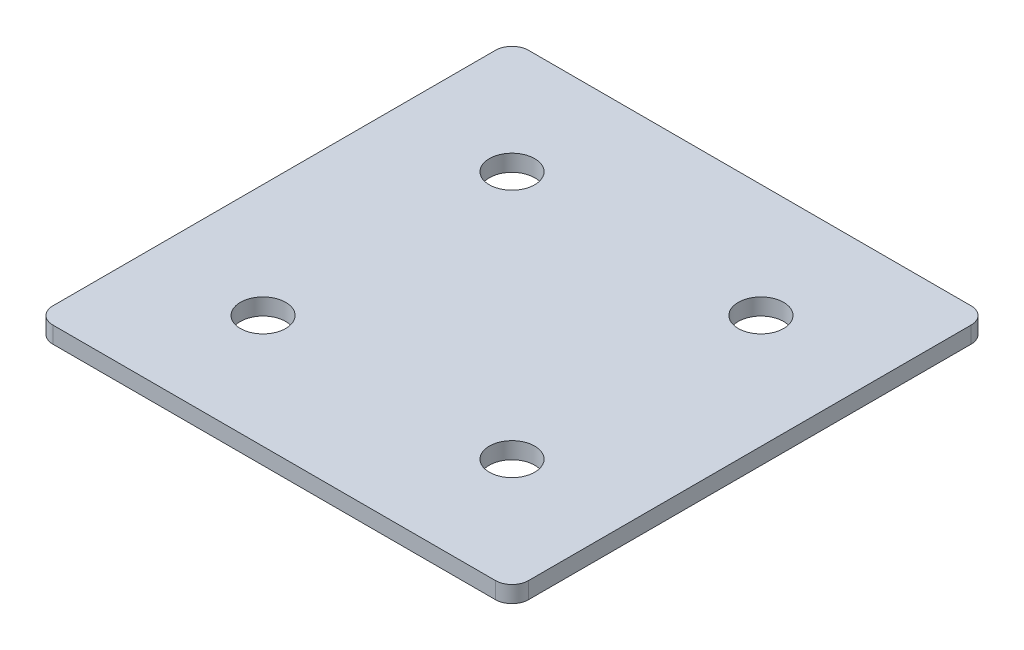
ISO-10303-21;
HEADER;
FILE_DESCRIPTION(('STEP AP214'),'2;1');
FILE_NAME('part.step','',(''),(''),'','','');
FILE_SCHEMA(('AUTOMOTIVE_DESIGN { 1 0 10303 214 1 1 1 1 }'));
ENDSEC;
DATA;
#1=APPLICATION_CONTEXT('core data for automotive mechanical design processes');
#2=APPLICATION_PROTOCOL_DEFINITION('international standard','automotive_design',2000,#1);
#3=PRODUCT_CONTEXT('',#1,'mechanical');
#4=PRODUCT('Part','Part','',(#3));
#5=PRODUCT_RELATED_PRODUCT_CATEGORY('part','',(#4));
#6=PRODUCT_DEFINITION_FORMATION('','',#4);
#7=PRODUCT_DEFINITION_CONTEXT('part definition',#1,'design');
#8=PRODUCT_DEFINITION('design','',#6,#7);
#9=PRODUCT_DEFINITION_SHAPE('','',#8);
#10=(LENGTH_UNIT() NAMED_UNIT(*) SI_UNIT(.MILLI.,.METRE.));
#11=(NAMED_UNIT(*) PLANE_ANGLE_UNIT() SI_UNIT($,.RADIAN.));
#12=(NAMED_UNIT(*) SI_UNIT($,.STERADIAN.) SOLID_ANGLE_UNIT());
#13=UNCERTAINTY_MEASURE_WITH_UNIT(LENGTH_MEASURE(1.E-05),#10,'distance_accuracy_value','');
#14=(GEOMETRIC_REPRESENTATION_CONTEXT(3) GLOBAL_UNCERTAINTY_ASSIGNED_CONTEXT((#13)) GLOBAL_UNIT_ASSIGNED_CONTEXT((#10,
#11,#12)) REPRESENTATION_CONTEXT('',''));
#15=CARTESIAN_POINT('',(0.,0.,0.));
#16=DIRECTION('',(0.,0.,1.));
#17=DIRECTION('',(1.,0.,0.));
#18=AXIS2_PLACEMENT_3D('',#15,#16,#17);
#19=CARTESIAN_POINT('',(-1.48251179552972,1.64126526075142,-24.1582429630034));
#20=DIRECTION('',(0.,-1.,0.));
#21=DIRECTION('',(0.,0.,-1.));
#22=AXIS2_PLACEMENT_3D('',#19,#20,#21);
#23=PLANE('',#22);
#24=CARTESIAN_POINT('',(21.0174882044703,1.64126526075142,20.8417570369966));
#25=DIRECTION('',(0.,1.,0.));
#26=DIRECTION('',(0.,0.,1.));
#27=AXIS2_PLACEMENT_3D('',#24,#25,#26);
#28=CIRCLE('',#27,4.1);
#29=CARTESIAN_POINT('',(21.0174882044703,1.64126526075142,24.9417570369966));
#30=VERTEX_POINT('',#29);
#31=EDGE_CURVE('E165',#30,#30,#28,.T.);
#32=ORIENTED_EDGE('',*,*,#31,.T.);
#33=EDGE_LOOP('',(#32));
#34=FACE_BOUND('',#33,.T.);
#35=CARTESIAN_POINT('',(-23.9825117955298,1.64126526075142,20.8417570369966));
#36=DIRECTION('',(0.,1.,0.));
#37=DIRECTION('',(0.,0.,1.));
#38=AXIS2_PLACEMENT_3D('',#35,#36,#37);
#39=CIRCLE('',#38,4.1);
#40=CARTESIAN_POINT('',(-23.9825117955298,1.64126526075142,24.9417570369966));
#41=VERTEX_POINT('',#40);
#42=EDGE_CURVE('E159',#41,#41,#39,.T.);
#43=ORIENTED_EDGE('',*,*,#42,.T.);
#44=EDGE_LOOP('',(#43));
#45=FACE_BOUND('',#44,.T.);
#46=CARTESIAN_POINT('',(21.0174882044703,1.64126526075142,-24.1582429630034));
#47=DIRECTION('',(0.,1.,0.));
#48=DIRECTION('',(0.,0.,1.));
#49=AXIS2_PLACEMENT_3D('',#46,#47,#48);
#50=CIRCLE('',#49,4.1);
#51=CARTESIAN_POINT('',(21.0174882044703,1.64126526075142,-20.0582429630034));
#52=VERTEX_POINT('',#51);
#53=EDGE_CURVE('E154',#52,#52,#50,.T.);
#54=ORIENTED_EDGE('',*,*,#53,.T.);
#55=EDGE_LOOP('',(#54));
#56=FACE_BOUND('',#55,.T.);
#57=CARTESIAN_POINT('',(-23.9825117955298,1.64126526075142,-24.1582429630034));
#58=DIRECTION('',(0.,1.,0.));
#59=DIRECTION('',(0.,0.,1.));
#60=AXIS2_PLACEMENT_3D('',#57,#58,#59);
#61=CIRCLE('',#60,4.1);
#62=CARTESIAN_POINT('',(-23.9825117955298,1.64126526075142,-20.0582429630034));
#63=VERTEX_POINT('',#62);
#64=EDGE_CURVE('E147',#63,#63,#61,.T.);
#65=ORIENTED_EDGE('',*,*,#64,.T.);
#66=EDGE_LOOP('',(#65));
#67=FACE_BOUND('',#66,.T.);
#68=DIRECTION('',(0.,0.,-1.));
#69=VECTOR('',#68,1.);
#70=CARTESIAN_POINT('',(41.5174882044704,1.64126526075142,41.3417570369966));
#71=LINE('',#70,#69);
#72=CARTESIAN_POINT('',(41.5174882044704,1.64126526075142,38.3417570369966));
#73=VERTEX_POINT('',#72);
#74=CARTESIAN_POINT('',(41.5174882044704,1.64126526075142,-41.6582429630034));
#75=VERTEX_POINT('',#74);
#76=EDGE_CURVE('E106',#73,#75,#71,.T.);
#77=ORIENTED_EDGE('',*,*,#76,.F.);
#78=CARTESIAN_POINT('',(38.5174882044704,1.64126526075142,38.3417570369966));
#79=DIRECTION('',(0.,-1.,0.));
#80=DIRECTION('',(0.,0.,-1.));
#81=AXIS2_PLACEMENT_3D('',#78,#79,#80);
#82=CIRCLE('',#81,3.);
#83=CARTESIAN_POINT('',(38.5174882044704,1.64126526075142,41.3417570369966));
#84=VERTEX_POINT('',#83);
#85=EDGE_CURVE('E128',#73,#84,#82,.T.);
#86=ORIENTED_EDGE('',*,*,#85,.T.);
#87=DIRECTION('',(1.,0.,0.));
#88=VECTOR('',#87,1.);
#89=CARTESIAN_POINT('',(-44.4825117955298,1.64126526075142,41.3417570369966));
#90=LINE('',#89,#88);
#91=CARTESIAN_POINT('',(-41.4825117955298,1.64126526075142,41.3417570369966));
#92=VERTEX_POINT('',#91);
#93=EDGE_CURVE('E110',#92,#84,#90,.T.);
#94=ORIENTED_EDGE('',*,*,#93,.F.);
#95=CARTESIAN_POINT('',(-41.4825117955298,1.64126526075142,38.3417570369966));
#96=DIRECTION('',(0.,-1.,0.));
#97=DIRECTION('',(0.,0.,-1.));
#98=AXIS2_PLACEMENT_3D('',#95,#96,#97);
#99=CIRCLE('',#98,3.);
#100=CARTESIAN_POINT('',(-44.4825117955298,1.64126526075142,38.3417570369966));
#101=VERTEX_POINT('',#100);
#102=EDGE_CURVE('E105',#92,#101,#99,.T.);
#103=ORIENTED_EDGE('',*,*,#102,.T.);
#104=DIRECTION('',(0.,0.,1.));
#105=VECTOR('',#104,1.);
#106=CARTESIAN_POINT('',(-44.4825117955298,1.64126526075142,-44.6582429630034));
#107=LINE('',#106,#105);
#108=CARTESIAN_POINT('',(-44.4825117955298,1.64126526075142,-41.6582429630034));
#109=VERTEX_POINT('',#108);
#110=EDGE_CURVE('E137',#109,#101,#107,.T.);
#111=ORIENTED_EDGE('',*,*,#110,.F.);
#112=CARTESIAN_POINT('',(-41.4825117955298,1.64126526075142,-41.6582429630034));
#113=DIRECTION('',(0.,-1.,0.));
#114=DIRECTION('',(0.,0.,-1.));
#115=AXIS2_PLACEMENT_3D('',#112,#113,#114);
#116=CIRCLE('',#115,3.);
#117=CARTESIAN_POINT('',(-41.4825117955298,1.64126526075142,-44.6582429630034));
#118=VERTEX_POINT('',#117);
#119=EDGE_CURVE('E31',#109,#118,#116,.T.);
#120=ORIENTED_EDGE('',*,*,#119,.T.);
#121=DIRECTION('',(-1.,0.,0.));
#122=VECTOR('',#121,1.);
#123=CARTESIAN_POINT('',(41.5174882044704,1.64126526075142,-44.6582429630034));
#124=LINE('',#123,#122);
#125=CARTESIAN_POINT('',(38.5174882044704,1.64126526075142,-44.6582429630034));
#126=VERTEX_POINT('',#125);
#127=EDGE_CURVE('E138',#126,#118,#124,.T.);
#128=ORIENTED_EDGE('',*,*,#127,.F.);
#129=CARTESIAN_POINT('',(38.5174882044704,1.64126526075142,-41.6582429630034));
#130=DIRECTION('',(0.,-1.,0.));
#131=DIRECTION('',(0.,0.,-1.));
#132=AXIS2_PLACEMENT_3D('',#129,#130,#131);
#133=CIRCLE('',#132,3.);
#134=EDGE_CURVE('E126',#126,#75,#133,.T.);
#135=ORIENTED_EDGE('',*,*,#134,.T.);
#136=EDGE_LOOP('',(#77,#86,#94,#103,#111,#120,#128,#135));
#137=FACE_BOUND('',#136,.T.);
#138=ADVANCED_FACE('F16',(#34,#45,#56,#67,#137),#23,.T.);
#139=CARTESIAN_POINT('',(41.5174882044704,1.64126526075142,-44.6582429630034));
#140=DIRECTION('',(0.,0.,-1.));
#141=DIRECTION('',(-1.,0.,0.));
#142=AXIS2_PLACEMENT_3D('',#139,#140,#141);
#143=PLANE('',#142);
#144=DIRECTION('',(-1.,0.,0.));
#145=VECTOR('',#144,1.);
#146=CARTESIAN_POINT('',(41.5174882044704,4.64126526075142,-44.6582429630034));
#147=LINE('',#146,#145);
#148=CARTESIAN_POINT('',(38.5174882044704,4.64126526075142,-44.6582429630034));
#149=VERTEX_POINT('',#148);
#150=CARTESIAN_POINT('',(-41.4825117955298,4.64126526075142,-44.6582429630034));
#151=VERTEX_POINT('',#150);
#152=EDGE_CURVE('E144',#149,#151,#147,.T.);
#153=ORIENTED_EDGE('',*,*,#152,.F.);
#154=DIRECTION('',(0.,1.,0.));
#155=VECTOR('',#154,1.);
#156=CARTESIAN_POINT('',(38.5174882044704,1.64126526075142,-44.6582429630034));
#157=LINE('',#156,#155);
#158=EDGE_CURVE('E38',#149,#126,#157,.F.);
#159=ORIENTED_EDGE('',*,*,#158,.T.);
#160=ORIENTED_EDGE('',*,*,#127,.T.);
#161=DIRECTION('',(0.,1.,0.));
#162=VECTOR('',#161,1.);
#163=CARTESIAN_POINT('',(-41.4825117955298,1.64126526075142,-44.6582429630034));
#164=LINE('',#163,#162);
#165=EDGE_CURVE('E130',#118,#151,#164,.T.);
#166=ORIENTED_EDGE('',*,*,#165,.T.);
#167=EDGE_LOOP('',(#153,#159,#160,#166));
#168=FACE_BOUND('',#167,.T.);
#169=ADVANCED_FACE('F206',(#168),#143,.T.);
#170=CARTESIAN_POINT('',(41.5174882044704,1.64126526075142,41.3417570369966));
#171=DIRECTION('',(1.,0.,0.));
#172=DIRECTION('',(0.,0.,-1.));
#173=AXIS2_PLACEMENT_3D('',#170,#171,#172);
#174=PLANE('',#173);
#175=DIRECTION('',(0.,0.,-1.));
#176=VECTOR('',#175,1.);
#177=CARTESIAN_POINT('',(41.5174882044704,4.64126526075142,41.3417570369966));
#178=LINE('',#177,#176);
#179=CARTESIAN_POINT('',(41.5174882044704,4.64126526075142,38.3417570369966));
#180=VERTEX_POINT('',#179);
#181=CARTESIAN_POINT('',(41.5174882044704,4.64126526075142,-41.6582429630034));
#182=VERTEX_POINT('',#181);
#183=EDGE_CURVE('E102',#180,#182,#178,.T.);
#184=ORIENTED_EDGE('',*,*,#183,.F.);
#185=DIRECTION('',(0.,1.,0.));
#186=VECTOR('',#185,1.);
#187=CARTESIAN_POINT('',(41.5174882044704,1.64126526075142,38.3417570369966));
#188=LINE('',#187,#186);
#189=EDGE_CURVE('E122',#180,#73,#188,.F.);
#190=ORIENTED_EDGE('',*,*,#189,.T.);
#191=ORIENTED_EDGE('',*,*,#76,.T.);
#192=DIRECTION('',(0.,1.,0.));
#193=VECTOR('',#192,1.);
#194=CARTESIAN_POINT('',(41.5174882044704,1.64126526075142,-41.6582429630034));
#195=LINE('',#194,#193);
#196=EDGE_CURVE('E119',#75,#182,#195,.T.);
#197=ORIENTED_EDGE('',*,*,#196,.T.);
#198=EDGE_LOOP('',(#184,#190,#191,#197));
#199=FACE_BOUND('',#198,.T.);
#200=ADVANCED_FACE('F211',(#199),#174,.T.);
#201=CARTESIAN_POINT('',(-44.4825117955298,1.64126526075142,41.3417570369966));
#202=DIRECTION('',(0.,0.,1.));
#203=DIRECTION('',(1.,0.,0.));
#204=AXIS2_PLACEMENT_3D('',#201,#202,#203);
#205=PLANE('',#204);
#206=ORIENTED_EDGE('',*,*,#93,.T.);
#207=DIRECTION('',(0.,1.,0.));
#208=VECTOR('',#207,1.);
#209=CARTESIAN_POINT('',(38.5174882044704,1.64126526075142,41.3417570369966));
#210=LINE('',#209,#208);
#211=CARTESIAN_POINT('',(38.5174882044704,4.64126526075142,41.3417570369966));
#212=VERTEX_POINT('',#211);
#213=EDGE_CURVE('E93',#84,#212,#210,.T.);
#214=ORIENTED_EDGE('',*,*,#213,.T.);
#215=DIRECTION('',(1.,0.,0.));
#216=VECTOR('',#215,1.);
#217=CARTESIAN_POINT('',(-44.4825117955298,4.64126526075142,41.3417570369966));
#218=LINE('',#217,#216);
#219=CARTESIAN_POINT('',(-41.4825117955298,4.64126526075142,41.3417570369966));
#220=VERTEX_POINT('',#219);
#221=EDGE_CURVE('E85',#220,#212,#218,.T.);
#222=ORIENTED_EDGE('',*,*,#221,.F.);
#223=DIRECTION('',(0.,1.,0.));
#224=VECTOR('',#223,1.);
#225=CARTESIAN_POINT('',(-41.4825117955298,1.64126526075142,41.3417570369966));
#226=LINE('',#225,#224);
#227=EDGE_CURVE('E99',#220,#92,#226,.F.);
#228=ORIENTED_EDGE('',*,*,#227,.T.);
#229=EDGE_LOOP('',(#206,#214,#222,#228));
#230=FACE_BOUND('',#229,.T.);
#231=ADVANCED_FACE('F98',(#230),#205,.T.);
#232=CARTESIAN_POINT('',(-44.4825117955298,1.64126526075142,-44.6582429630034));
#233=DIRECTION('',(-1.,0.,0.));
#234=DIRECTION('',(0.,0.,1.));
#235=AXIS2_PLACEMENT_3D('',#232,#233,#234);
#236=PLANE('',#235);
#237=DIRECTION('',(0.,0.,1.));
#238=VECTOR('',#237,1.);
#239=CARTESIAN_POINT('',(-44.4825117955298,4.64126526075142,-44.6582429630034));
#240=LINE('',#239,#238);
#241=CARTESIAN_POINT('',(-44.4825117955298,4.64126526075142,-41.6582429630034));
#242=VERTEX_POINT('',#241);
#243=CARTESIAN_POINT('',(-44.4825117955298,4.64126526075142,38.3417570369966));
#244=VERTEX_POINT('',#243);
#245=EDGE_CURVE('E87',#242,#244,#240,.T.);
#246=ORIENTED_EDGE('',*,*,#245,.F.);
#247=DIRECTION('',(0.,1.,0.));
#248=VECTOR('',#247,1.);
#249=CARTESIAN_POINT('',(-44.4825117955298,1.64126526075142,-41.6582429630034));
#250=LINE('',#249,#248);
#251=EDGE_CURVE('E10',#242,#109,#250,.F.);
#252=ORIENTED_EDGE('',*,*,#251,.T.);
#253=ORIENTED_EDGE('',*,*,#110,.T.);
#254=DIRECTION('',(0.,1.,0.));
#255=VECTOR('',#254,1.);
#256=CARTESIAN_POINT('',(-44.4825117955298,1.64126526075142,38.3417570369966));
#257=LINE('',#256,#255);
#258=EDGE_CURVE('E24',#101,#244,#257,.T.);
#259=ORIENTED_EDGE('',*,*,#258,.T.);
#260=EDGE_LOOP('',(#246,#252,#253,#259));
#261=FACE_BOUND('',#260,.T.);
#262=ADVANCED_FACE('F135',(#261),#236,.T.);
#263=CARTESIAN_POINT('',(-1.48251179552972,4.64126526075142,-24.1582429630034));
#264=DIRECTION('',(0.,-1.,0.));
#265=DIRECTION('',(0.,0.,-1.));
#266=AXIS2_PLACEMENT_3D('',#263,#264,#265);
#267=PLANE('',#266);
#268=CARTESIAN_POINT('',(21.0174882044703,4.64126526075142,20.8417570369966));
#269=DIRECTION('',(0.,1.,0.));
#270=DIRECTION('',(0.,0.,1.));
#271=AXIS2_PLACEMENT_3D('',#268,#269,#270);
#272=CIRCLE('',#271,4.1);
#273=CARTESIAN_POINT('',(21.0174882044703,4.64126526075142,24.9417570369966));
#274=VERTEX_POINT('',#273);
#275=EDGE_CURVE('E168',#274,#274,#272,.T.);
#276=ORIENTED_EDGE('',*,*,#275,.F.);
#277=EDGE_LOOP('',(#276));
#278=FACE_BOUND('',#277,.T.);
#279=CARTESIAN_POINT('',(-23.9825117955298,4.64126526075142,20.8417570369966));
#280=DIRECTION('',(0.,1.,0.));
#281=DIRECTION('',(0.,0.,1.));
#282=AXIS2_PLACEMENT_3D('',#279,#280,#281);
#283=CIRCLE('',#282,4.1);
#284=CARTESIAN_POINT('',(-23.9825117955298,4.64126526075142,24.9417570369966));
#285=VERTEX_POINT('',#284);
#286=EDGE_CURVE('E162',#285,#285,#283,.T.);
#287=ORIENTED_EDGE('',*,*,#286,.F.);
#288=EDGE_LOOP('',(#287));
#289=FACE_BOUND('',#288,.T.);
#290=CARTESIAN_POINT('',(21.0174882044703,4.64126526075142,-24.1582429630034));
#291=DIRECTION('',(0.,1.,0.));
#292=DIRECTION('',(0.,0.,1.));
#293=AXIS2_PLACEMENT_3D('',#290,#291,#292);
#294=CIRCLE('',#293,4.1);
#295=CARTESIAN_POINT('',(21.0174882044703,4.64126526075142,-20.0582429630034));
#296=VERTEX_POINT('',#295);
#297=EDGE_CURVE('E156',#296,#296,#294,.T.);
#298=ORIENTED_EDGE('',*,*,#297,.F.);
#299=EDGE_LOOP('',(#298));
#300=FACE_BOUND('',#299,.T.);
#301=CARTESIAN_POINT('',(-23.9825117955298,4.64126526075142,-24.1582429630034));
#302=DIRECTION('',(0.,1.,0.));
#303=DIRECTION('',(0.,0.,1.));
#304=AXIS2_PLACEMENT_3D('',#301,#302,#303);
#305=CIRCLE('',#304,4.1);
#306=CARTESIAN_POINT('',(-23.9825117955298,4.64126526075142,-20.0582429630034));
#307=VERTEX_POINT('',#306);
#308=EDGE_CURVE('E149',#307,#307,#305,.T.);
#309=ORIENTED_EDGE('',*,*,#308,.F.);
#310=EDGE_LOOP('',(#309));
#311=FACE_BOUND('',#310,.T.);
#312=ORIENTED_EDGE('',*,*,#221,.T.);
#313=CARTESIAN_POINT('',(38.5174882044704,4.64126526075142,38.3417570369966));
#314=DIRECTION('',(0.,-1.,0.));
#315=DIRECTION('',(0.,0.,-1.));
#316=AXIS2_PLACEMENT_3D('',#313,#314,#315);
#317=CIRCLE('',#316,3.);
#318=EDGE_CURVE('E117',#212,#180,#317,.F.);
#319=ORIENTED_EDGE('',*,*,#318,.T.);
#320=ORIENTED_EDGE('',*,*,#183,.T.);
#321=CARTESIAN_POINT('',(38.5174882044704,4.64126526075142,-41.6582429630034));
#322=DIRECTION('',(0.,-1.,0.));
#323=DIRECTION('',(0.,0.,-1.));
#324=AXIS2_PLACEMENT_3D('',#321,#322,#323);
#325=CIRCLE('',#324,3.);
#326=EDGE_CURVE('E115',#182,#149,#325,.F.);
#327=ORIENTED_EDGE('',*,*,#326,.T.);
#328=ORIENTED_EDGE('',*,*,#152,.T.);
#329=CARTESIAN_POINT('',(-41.4825117955298,4.64126526075142,-41.6582429630034));
#330=DIRECTION('',(0.,-1.,0.));
#331=DIRECTION('',(0.,0.,-1.));
#332=AXIS2_PLACEMENT_3D('',#329,#330,#331);
#333=CIRCLE('',#332,3.);
#334=EDGE_CURVE('E92',#151,#242,#333,.F.);
#335=ORIENTED_EDGE('',*,*,#334,.T.);
#336=ORIENTED_EDGE('',*,*,#245,.T.);
#337=CARTESIAN_POINT('',(-41.4825117955298,4.64126526075142,38.3417570369966));
#338=DIRECTION('',(0.,-1.,0.));
#339=DIRECTION('',(0.,0.,-1.));
#340=AXIS2_PLACEMENT_3D('',#337,#338,#339);
#341=CIRCLE('',#340,3.);
#342=EDGE_CURVE('E82',#244,#220,#341,.F.);
#343=ORIENTED_EDGE('',*,*,#342,.T.);
#344=EDGE_LOOP('',(#312,#319,#320,#327,#328,#335,#336,#343));
#345=FACE_BOUND('',#344,.T.);
#346=ADVANCED_FACE('F84',(#278,#289,#300,#311,#345),#267,.F.);
#347=CARTESIAN_POINT('',(-23.9825117955298,1.64126526075142,-24.1582429630034));
#348=DIRECTION('',(0.,1.,0.));
#349=DIRECTION('',(0.,0.,1.));
#350=AXIS2_PLACEMENT_3D('',#347,#348,#349);
#351=CYLINDRICAL_SURFACE('',#350,4.1);
#352=ORIENTED_EDGE('',*,*,#64,.F.);
#353=EDGE_LOOP('',(#352));
#354=FACE_BOUND('',#353,.T.);
#355=ORIENTED_EDGE('',*,*,#308,.T.);
#356=EDGE_LOOP('',(#355));
#357=FACE_BOUND('',#356,.T.);
#358=ADVANCED_FACE('F186',(#354,#357),#351,.F.);
#359=CARTESIAN_POINT('',(21.0174882044703,1.64126526075142,-24.1582429630034));
#360=DIRECTION('',(0.,1.,0.));
#361=DIRECTION('',(0.,0.,1.));
#362=AXIS2_PLACEMENT_3D('',#359,#360,#361);
#363=CYLINDRICAL_SURFACE('',#362,4.1);
#364=ORIENTED_EDGE('',*,*,#53,.F.);
#365=EDGE_LOOP('',(#364));
#366=FACE_BOUND('',#365,.T.);
#367=ORIENTED_EDGE('',*,*,#297,.T.);
#368=EDGE_LOOP('',(#367));
#369=FACE_BOUND('',#368,.T.);
#370=ADVANCED_FACE('F195',(#366,#369),#363,.F.);
#371=CARTESIAN_POINT('',(-23.9825117955298,1.64126526075142,20.8417570369966));
#372=DIRECTION('',(0.,1.,0.));
#373=DIRECTION('',(0.,0.,1.));
#374=AXIS2_PLACEMENT_3D('',#371,#372,#373);
#375=CYLINDRICAL_SURFACE('',#374,4.1);
#376=ORIENTED_EDGE('',*,*,#42,.F.);
#377=EDGE_LOOP('',(#376));
#378=FACE_BOUND('',#377,.T.);
#379=ORIENTED_EDGE('',*,*,#286,.T.);
#380=EDGE_LOOP('',(#379));
#381=FACE_BOUND('',#380,.T.);
#382=ADVANCED_FACE('F180',(#378,#381),#375,.F.);
#383=CARTESIAN_POINT('',(21.0174882044703,1.64126526075142,20.8417570369966));
#384=DIRECTION('',(0.,1.,0.));
#385=DIRECTION('',(0.,0.,1.));
#386=AXIS2_PLACEMENT_3D('',#383,#384,#385);
#387=CYLINDRICAL_SURFACE('',#386,4.1);
#388=ORIENTED_EDGE('',*,*,#31,.F.);
#389=EDGE_LOOP('',(#388));
#390=FACE_BOUND('',#389,.T.);
#391=ORIENTED_EDGE('',*,*,#275,.T.);
#392=EDGE_LOOP('',(#391));
#393=FACE_BOUND('',#392,.T.);
#394=ADVANCED_FACE('F176',(#390,#393),#387,.F.);
#395=CARTESIAN_POINT('',(38.5174882044704,1.64126526075142,38.3417570369966));
#396=DIRECTION('',(0.,1.,0.));
#397=DIRECTION('',(0.,0.,1.));
#398=AXIS2_PLACEMENT_3D('',#395,#396,#397);
#399=CYLINDRICAL_SURFACE('',#398,3.);
#400=ORIENTED_EDGE('',*,*,#85,.F.);
#401=ORIENTED_EDGE('',*,*,#189,.F.);
#402=ORIENTED_EDGE('',*,*,#318,.F.);
#403=ORIENTED_EDGE('',*,*,#213,.F.);
#404=EDGE_LOOP('',(#400,#401,#402,#403));
#405=FACE_BOUND('',#404,.T.);
#406=ADVANCED_FACE('F179',(#405),#399,.T.);
#407=CARTESIAN_POINT('',(38.5174882044704,1.64126526075142,-41.6582429630034));
#408=DIRECTION('',(0.,1.,0.));
#409=DIRECTION('',(0.,0.,1.));
#410=AXIS2_PLACEMENT_3D('',#407,#408,#409);
#411=CYLINDRICAL_SURFACE('',#410,3.);
#412=ORIENTED_EDGE('',*,*,#134,.F.);
#413=ORIENTED_EDGE('',*,*,#158,.F.);
#414=ORIENTED_EDGE('',*,*,#326,.F.);
#415=ORIENTED_EDGE('',*,*,#196,.F.);
#416=EDGE_LOOP('',(#412,#413,#414,#415));
#417=FACE_BOUND('',#416,.T.);
#418=ADVANCED_FACE('F216',(#417),#411,.T.);
#419=CARTESIAN_POINT('',(-41.4825117955298,1.64126526075142,-41.6582429630034));
#420=DIRECTION('',(0.,1.,0.));
#421=DIRECTION('',(0.,0.,1.));
#422=AXIS2_PLACEMENT_3D('',#419,#420,#421);
#423=CYLINDRICAL_SURFACE('',#422,3.);
#424=ORIENTED_EDGE('',*,*,#119,.F.);
#425=ORIENTED_EDGE('',*,*,#251,.F.);
#426=ORIENTED_EDGE('',*,*,#334,.F.);
#427=ORIENTED_EDGE('',*,*,#165,.F.);
#428=EDGE_LOOP('',(#424,#425,#426,#427));
#429=FACE_BOUND('',#428,.T.);
#430=ADVANCED_FACE('F219',(#429),#423,.T.);
#431=CARTESIAN_POINT('',(-41.4825117955298,1.64126526075142,38.3417570369966));
#432=DIRECTION('',(0.,1.,0.));
#433=DIRECTION('',(0.,0.,1.));
#434=AXIS2_PLACEMENT_3D('',#431,#432,#433);
#435=CYLINDRICAL_SURFACE('',#434,3.);
#436=ORIENTED_EDGE('',*,*,#102,.F.);
#437=ORIENTED_EDGE('',*,*,#227,.F.);
#438=ORIENTED_EDGE('',*,*,#342,.F.);
#439=ORIENTED_EDGE('',*,*,#258,.F.);
#440=EDGE_LOOP('',(#436,#437,#438,#439));
#441=FACE_BOUND('',#440,.T.);
#442=ADVANCED_FACE('F18',(#441),#435,.T.);
#443=CLOSED_SHELL('',(#138,#169,#200,#231,#262,#346,#358,#370,#382,#394,#406,#418,#430,#442));
#444=MANIFOLD_SOLID_BREP('B1',#443);
#445=ADVANCED_BREP_SHAPE_REPRESENTATION('',(#18,#444),#14);
#446=SHAPE_DEFINITION_REPRESENTATION(#9,#445);
ENDSEC;
END-ISO-10303-21;
